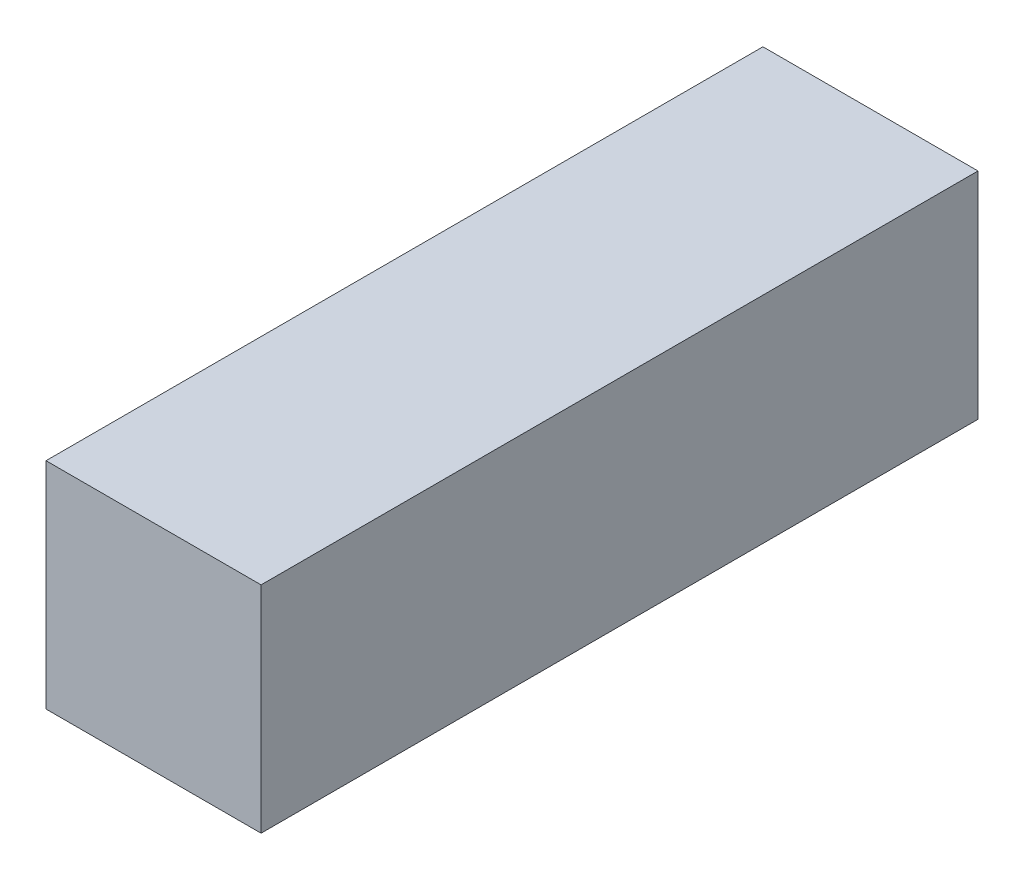
ISO-10303-21;
HEADER;
FILE_DESCRIPTION(('STEP AP214'),'2;1');
FILE_NAME('part.step','',(''),(''),'','','');
FILE_SCHEMA(('AUTOMOTIVE_DESIGN { 1 0 10303 214 1 1 1 1 }'));
ENDSEC;
DATA;
#1=APPLICATION_CONTEXT('core data for automotive mechanical design processes');
#2=APPLICATION_PROTOCOL_DEFINITION('international standard','automotive_design',2000,#1);
#3=PRODUCT_CONTEXT('',#1,'mechanical');
#4=PRODUCT('Part','Part','',(#3));
#5=PRODUCT_RELATED_PRODUCT_CATEGORY('part','',(#4));
#6=PRODUCT_DEFINITION_FORMATION('','',#4);
#7=PRODUCT_DEFINITION_CONTEXT('part definition',#1,'design');
#8=PRODUCT_DEFINITION('design','',#6,#7);
#9=PRODUCT_DEFINITION_SHAPE('','',#8);
#10=(LENGTH_UNIT() NAMED_UNIT(*) SI_UNIT(.MILLI.,.METRE.));
#11=(NAMED_UNIT(*) PLANE_ANGLE_UNIT() SI_UNIT($,.RADIAN.));
#12=(NAMED_UNIT(*) SI_UNIT($,.STERADIAN.) SOLID_ANGLE_UNIT());
#13=UNCERTAINTY_MEASURE_WITH_UNIT(LENGTH_MEASURE(1.E-05),#10,'distance_accuracy_value','');
#14=(GEOMETRIC_REPRESENTATION_CONTEXT(3) GLOBAL_UNCERTAINTY_ASSIGNED_CONTEXT((#13)) GLOBAL_UNIT_ASSIGNED_CONTEXT((#10,
#11,#12)) REPRESENTATION_CONTEXT('',''));
#15=CARTESIAN_POINT('',(0.,0.,0.));
#16=DIRECTION('',(0.,0.,1.));
#17=DIRECTION('',(1.,0.,0.));
#18=AXIS2_PLACEMENT_3D('',#15,#16,#17);
#19=CARTESIAN_POINT('',(-1.905,-1.905,12.7));
#20=DIRECTION('',(1.,0.,0.));
#21=DIRECTION('',(0.,0.,-1.));
#22=AXIS2_PLACEMENT_3D('',#19,#20,#21);
#23=PLANE('',#22);
#24=DIRECTION('',(0.,-1.,0.));
#25=VECTOR('',#24,1.);
#26=CARTESIAN_POINT('',(-1.905,-1.905,0.));
#27=LINE('',#26,#25);
#28=CARTESIAN_POINT('',(-1.905,1.905,0.));
#29=VERTEX_POINT('',#28);
#30=CARTESIAN_POINT('',(-1.905,-1.905,0.));
#31=VERTEX_POINT('',#30);
#32=EDGE_CURVE('E107',#29,#31,#27,.T.);
#33=ORIENTED_EDGE('',*,*,#32,.T.);
#34=DIRECTION('',(0.,0.,-1.));
#35=VECTOR('',#34,1.);
#36=CARTESIAN_POINT('',(-1.905,-1.905,12.7));
#37=LINE('',#36,#35);
#38=CARTESIAN_POINT('',(-1.905,-1.905,12.7));
#39=VERTEX_POINT('',#38);
#40=EDGE_CURVE('E11',#39,#31,#37,.T.);
#41=ORIENTED_EDGE('',*,*,#40,.F.);
#42=DIRECTION('',(0.,-1.,0.));
#43=VECTOR('',#42,1.);
#44=CARTESIAN_POINT('',(-1.905,-1.905,12.7));
#45=LINE('',#44,#43);
#46=CARTESIAN_POINT('',(-1.905,1.905,12.7));
#47=VERTEX_POINT('',#46);
#48=EDGE_CURVE('E91',#47,#39,#45,.T.);
#49=ORIENTED_EDGE('',*,*,#48,.F.);
#50=DIRECTION('',(0.,0.,-1.));
#51=VECTOR('',#50,1.);
#52=CARTESIAN_POINT('',(-1.905,1.905,12.7));
#53=LINE('',#52,#51);
#54=EDGE_CURVE('E103',#47,#29,#53,.T.);
#55=ORIENTED_EDGE('',*,*,#54,.T.);
#56=EDGE_LOOP('',(#33,#41,#49,#55));
#57=FACE_BOUND('',#56,.T.);
#58=ADVANCED_FACE('F39',(#57),#23,.F.);
#59=CARTESIAN_POINT('',(1.905,-1.905,12.7));
#60=DIRECTION('',(0.,1.,0.));
#61=DIRECTION('',(-1.,0.,0.));
#62=AXIS2_PLACEMENT_3D('',#59,#60,#61);
#63=PLANE('',#62);
#64=DIRECTION('',(1.,0.,0.));
#65=VECTOR('',#64,1.);
#66=CARTESIAN_POINT('',(1.905,-1.905,0.));
#67=LINE('',#66,#65);
#68=CARTESIAN_POINT('',(1.905,-1.905,0.));
#69=VERTEX_POINT('',#68);
#70=EDGE_CURVE('E96',#31,#69,#67,.T.);
#71=ORIENTED_EDGE('',*,*,#70,.T.);
#72=DIRECTION('',(0.,0.,-1.));
#73=VECTOR('',#72,1.);
#74=CARTESIAN_POINT('',(1.905,-1.905,12.7));
#75=LINE('',#74,#73);
#76=CARTESIAN_POINT('',(1.905,-1.905,12.7));
#77=VERTEX_POINT('',#76);
#78=EDGE_CURVE('E48',#77,#69,#75,.T.);
#79=ORIENTED_EDGE('',*,*,#78,.F.);
#80=DIRECTION('',(1.,0.,0.));
#81=VECTOR('',#80,1.);
#82=CARTESIAN_POINT('',(1.905,-1.905,12.7));
#83=LINE('',#82,#81);
#84=EDGE_CURVE('E86',#39,#77,#83,.T.);
#85=ORIENTED_EDGE('',*,*,#84,.F.);
#86=ORIENTED_EDGE('',*,*,#40,.T.);
#87=EDGE_LOOP('',(#71,#79,#85,#86));
#88=FACE_BOUND('',#87,.T.);
#89=ADVANCED_FACE('F95',(#88),#63,.F.);
#90=CARTESIAN_POINT('',(1.905,-1.905,12.7));
#91=DIRECTION('',(-1.,0.,0.));
#92=DIRECTION('',(0.,-1.,0.));
#93=AXIS2_PLACEMENT_3D('',#90,#91,#92);
#94=PLANE('',#93);
#95=DIRECTION('',(0.,1.,0.));
#96=VECTOR('',#95,1.);
#97=CARTESIAN_POINT('',(1.905,-1.905,0.));
#98=LINE('',#97,#96);
#99=CARTESIAN_POINT('',(1.905,1.905,0.));
#100=VERTEX_POINT('',#99);
#101=EDGE_CURVE('E73',#69,#100,#98,.T.);
#102=ORIENTED_EDGE('',*,*,#101,.T.);
#103=DIRECTION('',(0.,0.,-1.));
#104=VECTOR('',#103,1.);
#105=CARTESIAN_POINT('',(1.905,1.905,12.7));
#106=LINE('',#105,#104);
#107=CARTESIAN_POINT('',(1.905,1.905,12.7));
#108=VERTEX_POINT('',#107);
#109=EDGE_CURVE('E98',#108,#100,#106,.T.);
#110=ORIENTED_EDGE('',*,*,#109,.F.);
#111=DIRECTION('',(0.,1.,0.));
#112=VECTOR('',#111,1.);
#113=CARTESIAN_POINT('',(1.905,-1.905,12.7));
#114=LINE('',#113,#112);
#115=EDGE_CURVE('E89',#77,#108,#114,.T.);
#116=ORIENTED_EDGE('',*,*,#115,.F.);
#117=ORIENTED_EDGE('',*,*,#78,.T.);
#118=EDGE_LOOP('',(#102,#110,#116,#117));
#119=FACE_BOUND('',#118,.T.);
#120=ADVANCED_FACE('F99',(#119),#94,.F.);
#121=CARTESIAN_POINT('',(1.905,1.905,12.7));
#122=DIRECTION('',(0.,-1.,0.));
#123=DIRECTION('',(1.,0.,0.));
#124=AXIS2_PLACEMENT_3D('',#121,#122,#123);
#125=PLANE('',#124);
#126=DIRECTION('',(-1.,0.,0.));
#127=VECTOR('',#126,1.);
#128=CARTESIAN_POINT('',(1.905,1.905,0.));
#129=LINE('',#128,#127);
#130=EDGE_CURVE('E79',#100,#29,#129,.T.);
#131=ORIENTED_EDGE('',*,*,#130,.T.);
#132=ORIENTED_EDGE('',*,*,#54,.F.);
#133=DIRECTION('',(-1.,0.,0.));
#134=VECTOR('',#133,1.);
#135=CARTESIAN_POINT('',(1.905,1.905,12.7));
#136=LINE('',#135,#134);
#137=EDGE_CURVE('E56',#108,#47,#136,.T.);
#138=ORIENTED_EDGE('',*,*,#137,.F.);
#139=ORIENTED_EDGE('',*,*,#109,.T.);
#140=EDGE_LOOP('',(#131,#132,#138,#139));
#141=FACE_BOUND('',#140,.T.);
#142=ADVANCED_FACE('F120',(#141),#125,.F.);
#143=CARTESIAN_POINT('',(0.,0.,12.7));
#144=DIRECTION('',(0.,0.,1.));
#145=DIRECTION('',(1.,0.,0.));
#146=AXIS2_PLACEMENT_3D('',#143,#144,#145);
#147=PLANE('',#146);
#148=ORIENTED_EDGE('',*,*,#48,.T.);
#149=ORIENTED_EDGE('',*,*,#84,.T.);
#150=ORIENTED_EDGE('',*,*,#115,.T.);
#151=ORIENTED_EDGE('',*,*,#137,.T.);
#152=EDGE_LOOP('',(#148,#149,#150,#151));
#153=FACE_BOUND('',#152,.T.);
#154=ADVANCED_FACE('F87',(#153),#147,.T.);
#155=CARTESIAN_POINT('',(0.,0.,0.));
#156=DIRECTION('',(0.,0.,1.));
#157=DIRECTION('',(1.,0.,0.));
#158=AXIS2_PLACEMENT_3D('',#155,#156,#157);
#159=PLANE('',#158);
#160=ORIENTED_EDGE('',*,*,#32,.F.);
#161=ORIENTED_EDGE('',*,*,#130,.F.);
#162=ORIENTED_EDGE('',*,*,#101,.F.);
#163=ORIENTED_EDGE('',*,*,#70,.F.);
#164=EDGE_LOOP('',(#160,#161,#162,#163));
#165=FACE_BOUND('',#164,.T.);
#166=ADVANCED_FACE('F123',(#165),#159,.F.);
#167=CLOSED_SHELL('',(#58,#89,#120,#142,#154,#166));
#168=MANIFOLD_SOLID_BREP('B2',#167);
#169=ADVANCED_BREP_SHAPE_REPRESENTATION('',(#18,#168),#14);
#170=SHAPE_DEFINITION_REPRESENTATION(#9,#169);
ENDSEC;
END-ISO-10303-21;
